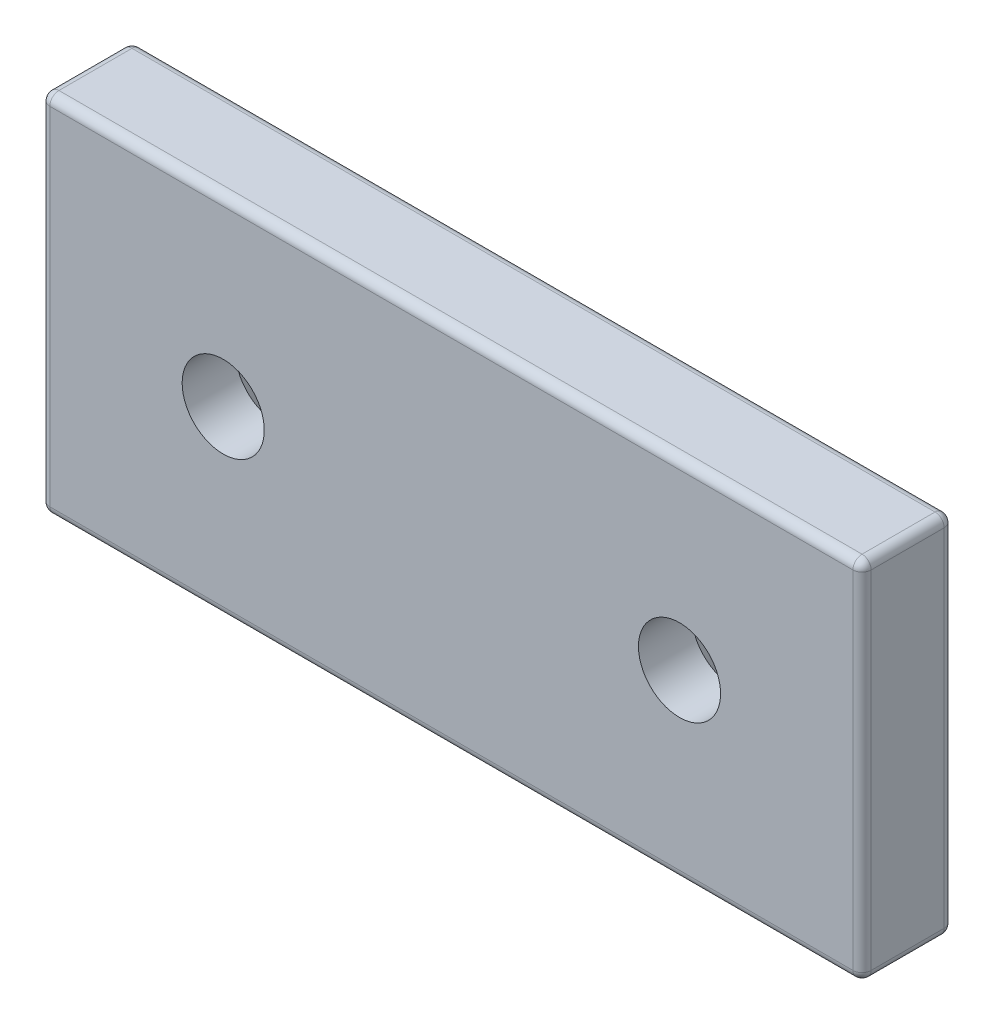
ISO-10303-21;
HEADER;
FILE_DESCRIPTION(('STEP AP214'),'2;1');
FILE_NAME('part.step','',(''),(''),'','','');
FILE_SCHEMA(('AUTOMOTIVE_DESIGN { 1 0 10303 214 1 1 1 1 }'));
ENDSEC;
DATA;
#1=APPLICATION_CONTEXT('core data for automotive mechanical design processes');
#2=APPLICATION_PROTOCOL_DEFINITION('international standard','automotive_design',2000,#1);
#3=PRODUCT_CONTEXT('',#1,'mechanical');
#4=PRODUCT('Part','Part','',(#3));
#5=PRODUCT_RELATED_PRODUCT_CATEGORY('part','',(#4));
#6=PRODUCT_DEFINITION_FORMATION('','',#4);
#7=PRODUCT_DEFINITION_CONTEXT('part definition',#1,'design');
#8=PRODUCT_DEFINITION('design','',#6,#7);
#9=PRODUCT_DEFINITION_SHAPE('','',#8);
#10=(LENGTH_UNIT() NAMED_UNIT(*) SI_UNIT(.MILLI.,.METRE.));
#11=(NAMED_UNIT(*) PLANE_ANGLE_UNIT() SI_UNIT($,.RADIAN.));
#12=(NAMED_UNIT(*) SI_UNIT($,.STERADIAN.) SOLID_ANGLE_UNIT());
#13=UNCERTAINTY_MEASURE_WITH_UNIT(LENGTH_MEASURE(1.E-05),#10,'distance_accuracy_value','');
#14=(GEOMETRIC_REPRESENTATION_CONTEXT(3) GLOBAL_UNCERTAINTY_ASSIGNED_CONTEXT((#13)) GLOBAL_UNIT_ASSIGNED_CONTEXT((#10,
#11,#12)) REPRESENTATION_CONTEXT('',''));
#15=CARTESIAN_POINT('',(0.,0.,0.));
#16=DIRECTION('',(0.,0.,1.));
#17=DIRECTION('',(1.,0.,0.));
#18=AXIS2_PLACEMENT_3D('',#15,#16,#17);
#19=CARTESIAN_POINT('',(45.,-20.,10.));
#20=DIRECTION('',(-1.,0.,0.));
#21=DIRECTION('',(0.,0.,1.));
#22=AXIS2_PLACEMENT_3D('',#19,#20,#21);
#23=PLANE('',#22);
#24=DIRECTION('',(0.,0.,-1.));
#25=VECTOR('',#24,1.);
#26=CARTESIAN_POINT('',(45.,-19.,10.));
#27=LINE('',#26,#25);
#28=CARTESIAN_POINT('',(45.,-19.,9.));
#29=VERTEX_POINT('',#28);
#30=CARTESIAN_POINT('',(45.,-19.,0.999999999999999));
#31=VERTEX_POINT('',#30);
#32=EDGE_CURVE('E145',#29,#31,#27,.T.);
#33=ORIENTED_EDGE('',*,*,#32,.T.);
#34=DIRECTION('',(0.,1.,0.));
#35=VECTOR('',#34,1.);
#36=CARTESIAN_POINT('',(45.,20.,0.999999999999999));
#37=LINE('',#36,#35);
#38=CARTESIAN_POINT('',(45.,19.,0.999999999999999));
#39=VERTEX_POINT('',#38);
#40=EDGE_CURVE('E195',#31,#39,#37,.T.);
#41=ORIENTED_EDGE('',*,*,#40,.T.);
#42=DIRECTION('',(0.,0.,-1.));
#43=VECTOR('',#42,1.);
#44=CARTESIAN_POINT('',(45.,19.,10.));
#45=LINE('',#44,#43);
#46=CARTESIAN_POINT('',(45.,19.,9.));
#47=VERTEX_POINT('',#46);
#48=EDGE_CURVE('E192',#39,#47,#45,.F.);
#49=ORIENTED_EDGE('',*,*,#48,.T.);
#50=DIRECTION('',(0.,1.,0.));
#51=VECTOR('',#50,1.);
#52=CARTESIAN_POINT('',(45.,-20.,9.));
#53=LINE('',#52,#51);
#54=EDGE_CURVE('E190',#47,#29,#53,.F.);
#55=ORIENTED_EDGE('',*,*,#54,.T.);
#56=EDGE_LOOP('',(#33,#41,#49,#55));
#57=FACE_BOUND('',#56,.T.);
#58=ADVANCED_FACE('F37',(#57),#23,.F.);
#59=CARTESIAN_POINT('',(-45.,20.,10.));
#60=DIRECTION('',(0.,-1.,0.));
#61=DIRECTION('',(0.,0.,-1.));
#62=AXIS2_PLACEMENT_3D('',#59,#60,#61);
#63=PLANE('',#62);
#64=DIRECTION('',(0.,0.,-1.));
#65=VECTOR('',#64,1.);
#66=CARTESIAN_POINT('',(44.,20.,10.));
#67=LINE('',#66,#65);
#68=CARTESIAN_POINT('',(44.,20.,9.));
#69=VERTEX_POINT('',#68);
#70=CARTESIAN_POINT('',(44.,20.,0.999999999999999));
#71=VERTEX_POINT('',#70);
#72=EDGE_CURVE('E183',#69,#71,#67,.T.);
#73=ORIENTED_EDGE('',*,*,#72,.T.);
#74=DIRECTION('',(-1.,0.,0.));
#75=VECTOR('',#74,1.);
#76=CARTESIAN_POINT('',(-45.,20.,0.999999999999999));
#77=LINE('',#76,#75);
#78=CARTESIAN_POINT('',(-44.,20.,0.999999999999999));
#79=VERTEX_POINT('',#78);
#80=EDGE_CURVE('E188',#71,#79,#77,.T.);
#81=ORIENTED_EDGE('',*,*,#80,.T.);
#82=DIRECTION('',(0.,0.,-1.));
#83=VECTOR('',#82,1.);
#84=CARTESIAN_POINT('',(-44.,20.,10.));
#85=LINE('',#84,#83);
#86=CARTESIAN_POINT('',(-44.,20.,9.));
#87=VERTEX_POINT('',#86);
#88=EDGE_CURVE('E185',#79,#87,#85,.F.);
#89=ORIENTED_EDGE('',*,*,#88,.T.);
#90=DIRECTION('',(-1.,0.,0.));
#91=VECTOR('',#90,1.);
#92=CARTESIAN_POINT('',(-45.,20.,9.));
#93=LINE('',#92,#91);
#94=EDGE_CURVE('E181',#87,#69,#93,.F.);
#95=ORIENTED_EDGE('',*,*,#94,.T.);
#96=EDGE_LOOP('',(#73,#81,#89,#95));
#97=FACE_BOUND('',#96,.T.);
#98=ADVANCED_FACE('F300',(#97),#63,.F.);
#99=CARTESIAN_POINT('',(-45.,-20.,10.));
#100=DIRECTION('',(1.,0.,0.));
#101=DIRECTION('',(0.,0.,-1.));
#102=AXIS2_PLACEMENT_3D('',#99,#100,#101);
#103=PLANE('',#102);
#104=DIRECTION('',(0.,0.,-1.));
#105=VECTOR('',#104,1.);
#106=CARTESIAN_POINT('',(-45.,19.,10.));
#107=LINE('',#106,#105);
#108=CARTESIAN_POINT('',(-45.,19.,9.));
#109=VERTEX_POINT('',#108);
#110=CARTESIAN_POINT('',(-45.,19.,0.999999999999999));
#111=VERTEX_POINT('',#110);
#112=EDGE_CURVE('E174',#109,#111,#107,.T.);
#113=ORIENTED_EDGE('',*,*,#112,.T.);
#114=DIRECTION('',(0.,-1.,0.));
#115=VECTOR('',#114,1.);
#116=CARTESIAN_POINT('',(-45.,-20.,0.999999999999999));
#117=LINE('',#116,#115);
#118=CARTESIAN_POINT('',(-45.,-19.,0.999999999999999));
#119=VERTEX_POINT('',#118);
#120=EDGE_CURVE('E179',#111,#119,#117,.T.);
#121=ORIENTED_EDGE('',*,*,#120,.T.);
#122=DIRECTION('',(0.,0.,-1.));
#123=VECTOR('',#122,1.);
#124=CARTESIAN_POINT('',(-45.,-19.,10.));
#125=LINE('',#124,#123);
#126=CARTESIAN_POINT('',(-45.,-19.,9.));
#127=VERTEX_POINT('',#126);
#128=EDGE_CURVE('E176',#119,#127,#125,.F.);
#129=ORIENTED_EDGE('',*,*,#128,.T.);
#130=DIRECTION('',(0.,-1.,0.));
#131=VECTOR('',#130,1.);
#132=CARTESIAN_POINT('',(-45.,-20.,9.));
#133=LINE('',#132,#131);
#134=EDGE_CURVE('E172',#127,#109,#133,.F.);
#135=ORIENTED_EDGE('',*,*,#134,.T.);
#136=EDGE_LOOP('',(#113,#121,#129,#135));
#137=FACE_BOUND('',#136,.T.);
#138=ADVANCED_FACE('F291',(#137),#103,.F.);
#139=CARTESIAN_POINT('',(-45.,-20.,10.));
#140=DIRECTION('',(0.,1.,0.));
#141=DIRECTION('',(0.,0.,1.));
#142=AXIS2_PLACEMENT_3D('',#139,#140,#141);
#143=PLANE('',#142);
#144=DIRECTION('',(0.,0.,-1.));
#145=VECTOR('',#144,1.);
#146=CARTESIAN_POINT('',(-44.,-20.,10.));
#147=LINE('',#146,#145);
#148=CARTESIAN_POINT('',(-44.,-20.,9.));
#149=VERTEX_POINT('',#148);
#150=CARTESIAN_POINT('',(-44.,-20.,0.999999999999999));
#151=VERTEX_POINT('',#150);
#152=EDGE_CURVE('E137',#149,#151,#147,.T.);
#153=ORIENTED_EDGE('',*,*,#152,.T.);
#154=DIRECTION('',(1.,0.,0.));
#155=VECTOR('',#154,1.);
#156=CARTESIAN_POINT('',(45.,-20.,0.999999999999999));
#157=LINE('',#156,#155);
#158=CARTESIAN_POINT('',(44.,-20.,0.999999999999999));
#159=VERTEX_POINT('',#158);
#160=EDGE_CURVE('E133',#151,#159,#157,.T.);
#161=ORIENTED_EDGE('',*,*,#160,.T.);
#162=DIRECTION('',(0.,0.,-1.));
#163=VECTOR('',#162,1.);
#164=CARTESIAN_POINT('',(44.,-20.,10.));
#165=LINE('',#164,#163);
#166=CARTESIAN_POINT('',(44.,-20.,9.));
#167=VERTEX_POINT('',#166);
#168=EDGE_CURVE('E125',#159,#167,#165,.F.);
#169=ORIENTED_EDGE('',*,*,#168,.T.);
#170=DIRECTION('',(1.,0.,0.));
#171=VECTOR('',#170,1.);
#172=CARTESIAN_POINT('',(-45.,-20.,9.));
#173=LINE('',#172,#171);
#174=EDGE_CURVE('E130',#167,#149,#173,.F.);
#175=ORIENTED_EDGE('',*,*,#174,.T.);
#176=EDGE_LOOP('',(#153,#161,#169,#175));
#177=FACE_BOUND('',#176,.T.);
#178=ADVANCED_FACE('F128',(#177),#143,.F.);
#179=CARTESIAN_POINT('',(0.,0.,10.));
#180=DIRECTION('',(0.,0.,-1.));
#181=DIRECTION('',(-1.,0.,0.));
#182=AXIS2_PLACEMENT_3D('',#179,#180,#181);
#183=PLANE('',#182);
#184=CARTESIAN_POINT('',(-25.,0.,10.));
#185=DIRECTION('',(0.,0.,-1.));
#186=DIRECTION('',(-1.,0.,0.));
#187=AXIS2_PLACEMENT_3D('',#184,#185,#186);
#188=CIRCLE('',#187,4.5);
#189=CARTESIAN_POINT('',(-29.5,0.,10.));
#190=VERTEX_POINT('',#189);
#191=EDGE_CURVE('E582',#190,#190,#188,.T.);
#192=ORIENTED_EDGE('',*,*,#191,.T.);
#193=EDGE_LOOP('',(#192));
#194=FACE_BOUND('',#193,.T.);
#195=CARTESIAN_POINT('',(25.,0.,10.));
#196=DIRECTION('',(0.,0.,-1.));
#197=DIRECTION('',(-1.,0.,0.));
#198=AXIS2_PLACEMENT_3D('',#195,#196,#197);
#199=CIRCLE('',#198,4.5);
#200=CARTESIAN_POINT('',(20.5,0.,10.));
#201=VERTEX_POINT('',#200);
#202=EDGE_CURVE('E167',#201,#201,#199,.T.);
#203=ORIENTED_EDGE('',*,*,#202,.T.);
#204=EDGE_LOOP('',(#203));
#205=FACE_BOUND('',#204,.T.);
#206=DIRECTION('',(0.,-1.,0.));
#207=VECTOR('',#206,1.);
#208=CARTESIAN_POINT('',(-44.,0.,10.));
#209=LINE('',#208,#207);
#210=CARTESIAN_POINT('',(-44.,19.,10.));
#211=VERTEX_POINT('',#210);
#212=CARTESIAN_POINT('',(-44.,-19.,10.));
#213=VERTEX_POINT('',#212);
#214=EDGE_CURVE('E46',#211,#213,#209,.T.);
#215=ORIENTED_EDGE('',*,*,#214,.T.);
#216=DIRECTION('',(1.,0.,0.));
#217=VECTOR('',#216,1.);
#218=CARTESIAN_POINT('',(0.,-19.,10.));
#219=LINE('',#218,#217);
#220=CARTESIAN_POINT('',(44.,-19.,10.));
#221=VERTEX_POINT('',#220);
#222=EDGE_CURVE('E11',#213,#221,#219,.T.);
#223=ORIENTED_EDGE('',*,*,#222,.T.);
#224=DIRECTION('',(0.,1.,0.));
#225=VECTOR('',#224,1.);
#226=CARTESIAN_POINT('',(44.,0.,10.));
#227=LINE('',#226,#225);
#228=CARTESIAN_POINT('',(44.,19.,10.));
#229=VERTEX_POINT('',#228);
#230=EDGE_CURVE('E206',#221,#229,#227,.T.);
#231=ORIENTED_EDGE('',*,*,#230,.T.);
#232=DIRECTION('',(-1.,0.,0.));
#233=VECTOR('',#232,1.);
#234=CARTESIAN_POINT('',(0.,19.,10.));
#235=LINE('',#234,#233);
#236=EDGE_CURVE('E57',#229,#211,#235,.T.);
#237=ORIENTED_EDGE('',*,*,#236,.T.);
#238=EDGE_LOOP('',(#215,#223,#231,#237));
#239=FACE_BOUND('',#238,.T.);
#240=ADVANCED_FACE('F532',(#194,#205,#239),#183,.F.);
#241=CARTESIAN_POINT('',(0.,0.,0.));
#242=DIRECTION('',(0.,0.,-1.));
#243=DIRECTION('',(-1.,0.,0.));
#244=AXIS2_PLACEMENT_3D('',#241,#242,#243);
#245=PLANE('',#244);
#246=CARTESIAN_POINT('',(-25.,0.,0.));
#247=DIRECTION('',(0.,0.,-1.));
#248=DIRECTION('',(-1.,0.,0.));
#249=AXIS2_PLACEMENT_3D('',#246,#247,#248);
#250=CIRCLE('',#249,8.65);
#251=CARTESIAN_POINT('',(-33.65,0.,0.));
#252=VERTEX_POINT('',#251);
#253=EDGE_CURVE('E597',#252,#252,#250,.T.);
#254=ORIENTED_EDGE('',*,*,#253,.F.);
#255=EDGE_LOOP('',(#254));
#256=FACE_BOUND('',#255,.T.);
#257=CARTESIAN_POINT('',(25.,0.,0.));
#258=DIRECTION('',(0.,0.,-1.));
#259=DIRECTION('',(-1.,0.,0.));
#260=AXIS2_PLACEMENT_3D('',#257,#258,#259);
#261=CIRCLE('',#260,8.65);
#262=CARTESIAN_POINT('',(16.35,0.,0.));
#263=VERTEX_POINT('',#262);
#264=EDGE_CURVE('E587',#263,#263,#261,.T.);
#265=ORIENTED_EDGE('',*,*,#264,.F.);
#266=EDGE_LOOP('',(#265));
#267=FACE_BOUND('',#266,.T.);
#268=DIRECTION('',(0.,-1.,0.));
#269=VECTOR('',#268,1.);
#270=CARTESIAN_POINT('',(-44.,20.,0.));
#271=LINE('',#270,#269);
#272=CARTESIAN_POINT('',(-44.,-19.,0.));
#273=VERTEX_POINT('',#272);
#274=CARTESIAN_POINT('',(-44.,19.,0.));
#275=VERTEX_POINT('',#274);
#276=EDGE_CURVE('E201',#273,#275,#271,.F.);
#277=ORIENTED_EDGE('',*,*,#276,.T.);
#278=DIRECTION('',(-1.,0.,0.));
#279=VECTOR('',#278,1.);
#280=CARTESIAN_POINT('',(45.,19.,0.));
#281=LINE('',#280,#279);
#282=CARTESIAN_POINT('',(44.,19.,0.));
#283=VERTEX_POINT('',#282);
#284=EDGE_CURVE('E203',#275,#283,#281,.F.);
#285=ORIENTED_EDGE('',*,*,#284,.T.);
#286=DIRECTION('',(0.,1.,0.));
#287=VECTOR('',#286,1.);
#288=CARTESIAN_POINT('',(44.,-20.,0.));
#289=LINE('',#288,#287);
#290=CARTESIAN_POINT('',(44.,-19.,0.));
#291=VERTEX_POINT('',#290);
#292=EDGE_CURVE('E197',#283,#291,#289,.F.);
#293=ORIENTED_EDGE('',*,*,#292,.T.);
#294=DIRECTION('',(1.,0.,0.));
#295=VECTOR('',#294,1.);
#296=CARTESIAN_POINT('',(-45.,-19.,0.));
#297=LINE('',#296,#295);
#298=EDGE_CURVE('E199',#291,#273,#297,.F.);
#299=ORIENTED_EDGE('',*,*,#298,.T.);
#300=EDGE_LOOP('',(#277,#285,#293,#299));
#301=FACE_BOUND('',#300,.T.);
#302=ADVANCED_FACE('F273',(#256,#267,#301),#245,.T.);
#303=CARTESIAN_POINT('',(44.,19.,10.));
#304=DIRECTION('',(0.,0.,-1.));
#305=DIRECTION('',(-1.,0.,0.));
#306=AXIS2_PLACEMENT_3D('',#303,#304,#305);
#307=CYLINDRICAL_SURFACE('',#306,1.);
#308=CARTESIAN_POINT('',(44.,19.,9.));
#309=DIRECTION('',(0.,0.,1.));
#310=DIRECTION('',(1.,0.,0.));
#311=AXIS2_PLACEMENT_3D('',#308,#309,#310);
#312=CIRCLE('',#311,1.);
#313=EDGE_CURVE('E41',#47,#69,#312,.T.);
#314=ORIENTED_EDGE('',*,*,#313,.F.);
#315=ORIENTED_EDGE('',*,*,#48,.F.);
#316=CARTESIAN_POINT('',(44.,19.,0.999999999999999));
#317=DIRECTION('',(0.,0.,-1.));
#318=DIRECTION('',(-1.,0.,0.));
#319=AXIS2_PLACEMENT_3D('',#316,#317,#318);
#320=CIRCLE('',#319,1.);
#321=EDGE_CURVE('E165',#71,#39,#320,.T.);
#322=ORIENTED_EDGE('',*,*,#321,.F.);
#323=ORIENTED_EDGE('',*,*,#72,.F.);
#324=EDGE_LOOP('',(#314,#315,#322,#323));
#325=FACE_BOUND('',#324,.T.);
#326=ADVANCED_FACE('F39',(#325),#307,.T.);
#327=CARTESIAN_POINT('',(44.,19.,9.));
#328=DIRECTION('',(0.,0.,1.));
#329=DIRECTION('',(1.,0.,0.));
#330=AXIS2_PLACEMENT_3D('',#327,#328,#329);
#331=SPHERICAL_SURFACE('',#330,1.);
#332=CARTESIAN_POINT('',(44.,19.,9.));
#333=DIRECTION('',(0.,1.,0.));
#334=DIRECTION('',(0.,0.,1.));
#335=AXIS2_PLACEMENT_3D('',#332,#333,#334);
#336=CIRCLE('',#335,1.);
#337=EDGE_CURVE('E252',#47,#229,#336,.F.);
#338=ORIENTED_EDGE('',*,*,#337,.F.);
#339=ORIENTED_EDGE('',*,*,#313,.T.);
#340=CARTESIAN_POINT('',(44.,19.,9.));
#341=DIRECTION('',(1.,0.,0.));
#342=DIRECTION('',(0.,0.,-1.));
#343=AXIS2_PLACEMENT_3D('',#340,#341,#342);
#344=CIRCLE('',#343,1.);
#345=EDGE_CURVE('E255',#229,#69,#344,.F.);
#346=ORIENTED_EDGE('',*,*,#345,.F.);
#347=EDGE_LOOP('',(#338,#339,#346));
#348=FACE_BOUND('',#347,.T.);
#349=ADVANCED_FACE('F305',(#348),#331,.T.);
#350=CARTESIAN_POINT('',(44.,19.,1.));
#351=DIRECTION('',(0.,0.,1.));
#352=DIRECTION('',(1.,0.,0.));
#353=AXIS2_PLACEMENT_3D('',#350,#351,#352);
#354=SPHERICAL_SURFACE('',#353,1.);
#355=CARTESIAN_POINT('',(44.,19.,1.));
#356=DIRECTION('',(1.,0.,0.));
#357=DIRECTION('',(0.,0.,-1.));
#358=AXIS2_PLACEMENT_3D('',#355,#356,#357);
#359=CIRCLE('',#358,1.);
#360=EDGE_CURVE('E246',#71,#283,#359,.F.);
#361=ORIENTED_EDGE('',*,*,#360,.F.);
#362=ORIENTED_EDGE('',*,*,#321,.T.);
#363=CARTESIAN_POINT('',(44.,19.,0.999999999999999));
#364=DIRECTION('',(0.,1.,0.));
#365=DIRECTION('',(0.,0.,1.));
#366=AXIS2_PLACEMENT_3D('',#363,#364,#365);
#367=CIRCLE('',#366,1.);
#368=EDGE_CURVE('E249',#283,#39,#367,.F.);
#369=ORIENTED_EDGE('',*,*,#368,.F.);
#370=EDGE_LOOP('',(#361,#362,#369));
#371=FACE_BOUND('',#370,.T.);
#372=ADVANCED_FACE('F262',(#371),#354,.T.);
#373=CARTESIAN_POINT('',(0.,19.,9.));
#374=DIRECTION('',(-1.,0.,0.));
#375=DIRECTION('',(0.,0.,1.));
#376=AXIS2_PLACEMENT_3D('',#373,#374,#375);
#377=CYLINDRICAL_SURFACE('',#376,1.);
#378=ORIENTED_EDGE('',*,*,#345,.T.);
#379=ORIENTED_EDGE('',*,*,#94,.F.);
#380=CARTESIAN_POINT('',(-44.,19.,9.));
#381=DIRECTION('',(-1.,0.,0.));
#382=DIRECTION('',(0.,0.,1.));
#383=AXIS2_PLACEMENT_3D('',#380,#381,#382);
#384=CIRCLE('',#383,1.);
#385=EDGE_CURVE('E241',#211,#87,#384,.T.);
#386=ORIENTED_EDGE('',*,*,#385,.F.);
#387=ORIENTED_EDGE('',*,*,#236,.F.);
#388=EDGE_LOOP('',(#378,#379,#386,#387));
#389=FACE_BOUND('',#388,.T.);
#390=ADVANCED_FACE('F308',(#389),#377,.T.);
#391=CARTESIAN_POINT('',(44.,0.,9.));
#392=DIRECTION('',(0.,1.,0.));
#393=DIRECTION('',(0.,0.,1.));
#394=AXIS2_PLACEMENT_3D('',#391,#392,#393);
#395=CYLINDRICAL_SURFACE('',#394,1.);
#396=ORIENTED_EDGE('',*,*,#337,.T.);
#397=ORIENTED_EDGE('',*,*,#230,.F.);
#398=CARTESIAN_POINT('',(44.,-19.,9.));
#399=DIRECTION('',(0.,-1.,0.));
#400=DIRECTION('',(0.,0.,-1.));
#401=AXIS2_PLACEMENT_3D('',#398,#399,#400);
#402=CIRCLE('',#401,1.);
#403=EDGE_CURVE('E149',#29,#221,#402,.T.);
#404=ORIENTED_EDGE('',*,*,#403,.F.);
#405=ORIENTED_EDGE('',*,*,#54,.F.);
#406=EDGE_LOOP('',(#396,#397,#404,#405));
#407=FACE_BOUND('',#406,.T.);
#408=ADVANCED_FACE('F490',(#407),#395,.T.);
#409=CARTESIAN_POINT('',(44.,-19.,10.));
#410=DIRECTION('',(0.,0.,-1.));
#411=DIRECTION('',(-1.,0.,0.));
#412=AXIS2_PLACEMENT_3D('',#409,#410,#411);
#413=CYLINDRICAL_SURFACE('',#412,1.);
#414=CARTESIAN_POINT('',(44.,-19.,0.999999999999999));
#415=DIRECTION('',(0.,0.,-1.));
#416=DIRECTION('',(-1.,0.,0.));
#417=AXIS2_PLACEMENT_3D('',#414,#415,#416);
#418=CIRCLE('',#417,1.);
#419=EDGE_CURVE('E150',#31,#159,#418,.T.);
#420=ORIENTED_EDGE('',*,*,#419,.F.);
#421=ORIENTED_EDGE('',*,*,#32,.F.);
#422=CARTESIAN_POINT('',(44.,-19.,9.));
#423=DIRECTION('',(0.,0.,1.));
#424=DIRECTION('',(1.,0.,0.));
#425=AXIS2_PLACEMENT_3D('',#422,#423,#424);
#426=CIRCLE('',#425,1.);
#427=EDGE_CURVE('E141',#167,#29,#426,.T.);
#428=ORIENTED_EDGE('',*,*,#427,.F.);
#429=ORIENTED_EDGE('',*,*,#168,.F.);
#430=EDGE_LOOP('',(#420,#421,#428,#429));
#431=FACE_BOUND('',#430,.T.);
#432=ADVANCED_FACE('F143',(#431),#413,.T.);
#433=CARTESIAN_POINT('',(44.,-20.,0.999999999999999));
#434=DIRECTION('',(0.,-1.,0.));
#435=DIRECTION('',(0.,0.,-1.));
#436=AXIS2_PLACEMENT_3D('',#433,#434,#435);
#437=CYLINDRICAL_SURFACE('',#436,1.);
#438=ORIENTED_EDGE('',*,*,#368,.T.);
#439=ORIENTED_EDGE('',*,*,#40,.F.);
#440=CARTESIAN_POINT('',(44.,-19.,1.));
#441=DIRECTION('',(0.,-1.,0.));
#442=DIRECTION('',(0.,0.,-1.));
#443=AXIS2_PLACEMENT_3D('',#440,#441,#442);
#444=CIRCLE('',#443,1.);
#445=EDGE_CURVE('E237',#291,#31,#444,.T.);
#446=ORIENTED_EDGE('',*,*,#445,.F.);
#447=ORIENTED_EDGE('',*,*,#292,.F.);
#448=EDGE_LOOP('',(#438,#439,#446,#447));
#449=FACE_BOUND('',#448,.T.);
#450=ADVANCED_FACE('F269',(#449),#437,.T.);
#451=CARTESIAN_POINT('',(-45.,19.,0.999999999999999));
#452=DIRECTION('',(1.,0.,0.));
#453=DIRECTION('',(0.,0.,-1.));
#454=AXIS2_PLACEMENT_3D('',#451,#452,#453);
#455=CYLINDRICAL_SURFACE('',#454,1.);
#456=ORIENTED_EDGE('',*,*,#360,.T.);
#457=ORIENTED_EDGE('',*,*,#284,.F.);
#458=CARTESIAN_POINT('',(-44.,19.,0.999999999999999));
#459=DIRECTION('',(-1.,0.,0.));
#460=DIRECTION('',(0.,0.,1.));
#461=AXIS2_PLACEMENT_3D('',#458,#459,#460);
#462=CIRCLE('',#461,1.);
#463=EDGE_CURVE('E234',#79,#275,#462,.T.);
#464=ORIENTED_EDGE('',*,*,#463,.F.);
#465=ORIENTED_EDGE('',*,*,#80,.F.);
#466=EDGE_LOOP('',(#456,#457,#464,#465));
#467=FACE_BOUND('',#466,.T.);
#468=ADVANCED_FACE('F279',(#467),#455,.T.);
#469=CARTESIAN_POINT('',(-44.,19.,10.));
#470=DIRECTION('',(0.,0.,-1.));
#471=DIRECTION('',(-1.,0.,0.));
#472=AXIS2_PLACEMENT_3D('',#469,#470,#471);
#473=CYLINDRICAL_SURFACE('',#472,1.);
#474=CARTESIAN_POINT('',(-44.,19.,9.));
#475=DIRECTION('',(0.,0.,1.));
#476=DIRECTION('',(1.,0.,0.));
#477=AXIS2_PLACEMENT_3D('',#474,#475,#476);
#478=CIRCLE('',#477,1.);
#479=EDGE_CURVE('E243',#87,#109,#478,.T.);
#480=ORIENTED_EDGE('',*,*,#479,.F.);
#481=ORIENTED_EDGE('',*,*,#88,.F.);
#482=CARTESIAN_POINT('',(-44.,19.,0.999999999999999));
#483=DIRECTION('',(0.,0.,-1.));
#484=DIRECTION('',(-1.,0.,0.));
#485=AXIS2_PLACEMENT_3D('',#482,#483,#484);
#486=CIRCLE('',#485,1.);
#487=EDGE_CURVE('E231',#111,#79,#486,.T.);
#488=ORIENTED_EDGE('',*,*,#487,.F.);
#489=ORIENTED_EDGE('',*,*,#112,.F.);
#490=EDGE_LOOP('',(#480,#481,#488,#489));
#491=FACE_BOUND('',#490,.T.);
#492=ADVANCED_FACE('F297',(#491),#473,.T.);
#493=CARTESIAN_POINT('',(-44.,19.,9.));
#494=DIRECTION('',(0.,0.,1.));
#495=DIRECTION('',(1.,0.,0.));
#496=AXIS2_PLACEMENT_3D('',#493,#494,#495);
#497=SPHERICAL_SURFACE('',#496,1.);
#498=ORIENTED_EDGE('',*,*,#385,.T.);
#499=ORIENTED_EDGE('',*,*,#479,.T.);
#500=CARTESIAN_POINT('',(-44.,19.,9.));
#501=DIRECTION('',(0.,1.,0.));
#502=DIRECTION('',(0.,0.,1.));
#503=AXIS2_PLACEMENT_3D('',#500,#501,#502);
#504=CIRCLE('',#503,1.);
#505=EDGE_CURVE('E156',#211,#109,#504,.F.);
#506=ORIENTED_EDGE('',*,*,#505,.F.);
#507=EDGE_LOOP('',(#498,#499,#506));
#508=FACE_BOUND('',#507,.T.);
#509=ADVANCED_FACE('F311',(#508),#497,.T.);
#510=CARTESIAN_POINT('',(44.,-19.,9.));
#511=DIRECTION('',(0.,0.,1.));
#512=DIRECTION('',(1.,0.,0.));
#513=AXIS2_PLACEMENT_3D('',#510,#511,#512);
#514=SPHERICAL_SURFACE('',#513,1.);
#515=ORIENTED_EDGE('',*,*,#427,.T.);
#516=ORIENTED_EDGE('',*,*,#403,.T.);
#517=CARTESIAN_POINT('',(44.,-19.,9.));
#518=DIRECTION('',(1.,0.,0.));
#519=DIRECTION('',(0.,0.,-1.));
#520=AXIS2_PLACEMENT_3D('',#517,#518,#519);
#521=CIRCLE('',#520,1.);
#522=EDGE_CURVE('E152',#167,#221,#521,.F.);
#523=ORIENTED_EDGE('',*,*,#522,.F.);
#524=EDGE_LOOP('',(#515,#516,#523));
#525=FACE_BOUND('',#524,.T.);
#526=ADVANCED_FACE('F153',(#525),#514,.T.);
#527=CARTESIAN_POINT('',(44.,-19.,1.));
#528=DIRECTION('',(0.,0.,1.));
#529=DIRECTION('',(1.,0.,0.));
#530=AXIS2_PLACEMENT_3D('',#527,#528,#529);
#531=SPHERICAL_SURFACE('',#530,1.);
#532=ORIENTED_EDGE('',*,*,#445,.T.);
#533=ORIENTED_EDGE('',*,*,#419,.T.);
#534=CARTESIAN_POINT('',(44.,-19.,0.999999999999999));
#535=DIRECTION('',(1.,0.,0.));
#536=DIRECTION('',(0.,0.,-1.));
#537=AXIS2_PLACEMENT_3D('',#534,#535,#536);
#538=CIRCLE('',#537,1.);
#539=EDGE_CURVE('E157',#291,#159,#538,.F.);
#540=ORIENTED_EDGE('',*,*,#539,.F.);
#541=EDGE_LOOP('',(#532,#533,#540));
#542=FACE_BOUND('',#541,.T.);
#543=ADVANCED_FACE('F326',(#542),#531,.T.);
#544=CARTESIAN_POINT('',(-44.,19.,1.));
#545=DIRECTION('',(0.,0.,1.));
#546=DIRECTION('',(1.,0.,0.));
#547=AXIS2_PLACEMENT_3D('',#544,#545,#546);
#548=SPHERICAL_SURFACE('',#547,1.);
#549=ORIENTED_EDGE('',*,*,#487,.T.);
#550=ORIENTED_EDGE('',*,*,#463,.T.);
#551=CARTESIAN_POINT('',(-44.,19.,1.));
#552=DIRECTION('',(0.,1.,0.));
#553=DIRECTION('',(0.,0.,1.));
#554=AXIS2_PLACEMENT_3D('',#551,#552,#553);
#555=CIRCLE('',#554,1.);
#556=EDGE_CURVE('E224',#111,#275,#555,.F.);
#557=ORIENTED_EDGE('',*,*,#556,.F.);
#558=EDGE_LOOP('',(#549,#550,#557));
#559=FACE_BOUND('',#558,.T.);
#560=ADVANCED_FACE('F282',(#559),#548,.T.);
#561=CARTESIAN_POINT('',(-44.,0.,9.));
#562=DIRECTION('',(0.,-1.,0.));
#563=DIRECTION('',(0.,0.,-1.));
#564=AXIS2_PLACEMENT_3D('',#561,#562,#563);
#565=CYLINDRICAL_SURFACE('',#564,1.);
#566=ORIENTED_EDGE('',*,*,#505,.T.);
#567=ORIENTED_EDGE('',*,*,#134,.F.);
#568=CARTESIAN_POINT('',(-44.,-19.,9.));
#569=DIRECTION('',(0.,-1.,0.));
#570=DIRECTION('',(0.,0.,-1.));
#571=AXIS2_PLACEMENT_3D('',#568,#569,#570);
#572=CIRCLE('',#571,1.);
#573=EDGE_CURVE('E221',#213,#127,#572,.T.);
#574=ORIENTED_EDGE('',*,*,#573,.F.);
#575=ORIENTED_EDGE('',*,*,#214,.F.);
#576=EDGE_LOOP('',(#566,#567,#574,#575));
#577=FACE_BOUND('',#576,.T.);
#578=ADVANCED_FACE('F314',(#577),#565,.T.);
#579=CARTESIAN_POINT('',(0.,-19.,9.));
#580=DIRECTION('',(1.,0.,0.));
#581=DIRECTION('',(0.,0.,-1.));
#582=AXIS2_PLACEMENT_3D('',#579,#580,#581);
#583=CYLINDRICAL_SURFACE('',#582,1.);
#584=ORIENTED_EDGE('',*,*,#522,.T.);
#585=ORIENTED_EDGE('',*,*,#222,.F.);
#586=CARTESIAN_POINT('',(-44.,-19.,9.));
#587=DIRECTION('',(-1.,0.,0.));
#588=DIRECTION('',(0.,0.,1.));
#589=AXIS2_PLACEMENT_3D('',#586,#587,#588);
#590=CIRCLE('',#589,1.);
#591=EDGE_CURVE('E161',#149,#213,#590,.T.);
#592=ORIENTED_EDGE('',*,*,#591,.F.);
#593=ORIENTED_EDGE('',*,*,#174,.F.);
#594=EDGE_LOOP('',(#584,#585,#592,#593));
#595=FACE_BOUND('',#594,.T.);
#596=ADVANCED_FACE('F159',(#595),#583,.T.);
#597=CARTESIAN_POINT('',(-45.,-19.,0.999999999999999));
#598=DIRECTION('',(-1.,0.,0.));
#599=DIRECTION('',(0.,0.,1.));
#600=AXIS2_PLACEMENT_3D('',#597,#598,#599);
#601=CYLINDRICAL_SURFACE('',#600,1.);
#602=ORIENTED_EDGE('',*,*,#539,.T.);
#603=ORIENTED_EDGE('',*,*,#160,.F.);
#604=CARTESIAN_POINT('',(-44.,-19.,1.));
#605=DIRECTION('',(-1.,0.,0.));
#606=DIRECTION('',(0.,0.,1.));
#607=AXIS2_PLACEMENT_3D('',#604,#605,#606);
#608=CIRCLE('',#607,1.);
#609=EDGE_CURVE('E217',#273,#151,#608,.T.);
#610=ORIENTED_EDGE('',*,*,#609,.F.);
#611=ORIENTED_EDGE('',*,*,#298,.F.);
#612=EDGE_LOOP('',(#602,#603,#610,#611));
#613=FACE_BOUND('',#612,.T.);
#614=ADVANCED_FACE('F324',(#613),#601,.T.);
#615=CARTESIAN_POINT('',(-44.,-20.,0.999999999999999));
#616=DIRECTION('',(0.,1.,0.));
#617=DIRECTION('',(0.,0.,1.));
#618=AXIS2_PLACEMENT_3D('',#615,#616,#617);
#619=CYLINDRICAL_SURFACE('',#618,1.);
#620=ORIENTED_EDGE('',*,*,#556,.T.);
#621=ORIENTED_EDGE('',*,*,#276,.F.);
#622=CARTESIAN_POINT('',(-44.,-19.,0.999999999999999));
#623=DIRECTION('',(0.,-1.,0.));
#624=DIRECTION('',(0.,0.,-1.));
#625=AXIS2_PLACEMENT_3D('',#622,#623,#624);
#626=CIRCLE('',#625,1.);
#627=EDGE_CURVE('E214',#119,#273,#626,.T.);
#628=ORIENTED_EDGE('',*,*,#627,.F.);
#629=ORIENTED_EDGE('',*,*,#120,.F.);
#630=EDGE_LOOP('',(#620,#621,#628,#629));
#631=FACE_BOUND('',#630,.T.);
#632=ADVANCED_FACE('F286',(#631),#619,.T.);
#633=CARTESIAN_POINT('',(-44.,-19.,9.));
#634=DIRECTION('',(0.,0.,1.));
#635=DIRECTION('',(1.,0.,0.));
#636=AXIS2_PLACEMENT_3D('',#633,#634,#635);
#637=SPHERICAL_SURFACE('',#636,1.);
#638=ORIENTED_EDGE('',*,*,#591,.T.);
#639=ORIENTED_EDGE('',*,*,#573,.T.);
#640=CARTESIAN_POINT('',(-44.,-19.,9.));
#641=DIRECTION('',(0.,0.,1.));
#642=DIRECTION('',(1.,0.,0.));
#643=AXIS2_PLACEMENT_3D('',#640,#641,#642);
#644=CIRCLE('',#643,1.);
#645=EDGE_CURVE('E212',#149,#127,#644,.F.);
#646=ORIENTED_EDGE('',*,*,#645,.F.);
#647=EDGE_LOOP('',(#638,#639,#646));
#648=FACE_BOUND('',#647,.T.);
#649=ADVANCED_FACE('F316',(#648),#637,.T.);
#650=CARTESIAN_POINT('',(-44.,-19.,1.));
#651=DIRECTION('',(0.,0.,1.));
#652=DIRECTION('',(1.,0.,0.));
#653=AXIS2_PLACEMENT_3D('',#650,#651,#652);
#654=SPHERICAL_SURFACE('',#653,1.);
#655=ORIENTED_EDGE('',*,*,#627,.T.);
#656=ORIENTED_EDGE('',*,*,#609,.T.);
#657=CARTESIAN_POINT('',(-44.,-19.,0.999999999999999));
#658=DIRECTION('',(0.,0.,-1.));
#659=DIRECTION('',(-1.,0.,0.));
#660=AXIS2_PLACEMENT_3D('',#657,#658,#659);
#661=CIRCLE('',#660,1.);
#662=EDGE_CURVE('E210',#119,#151,#661,.F.);
#663=ORIENTED_EDGE('',*,*,#662,.F.);
#664=EDGE_LOOP('',(#655,#656,#663));
#665=FACE_BOUND('',#664,.T.);
#666=ADVANCED_FACE('F322',(#665),#654,.T.);
#667=CARTESIAN_POINT('',(-44.,-19.,10.));
#668=DIRECTION('',(0.,0.,-1.));
#669=DIRECTION('',(-1.,0.,0.));
#670=AXIS2_PLACEMENT_3D('',#667,#668,#669);
#671=CYLINDRICAL_SURFACE('',#670,1.);
#672=ORIENTED_EDGE('',*,*,#645,.T.);
#673=ORIENTED_EDGE('',*,*,#128,.F.);
#674=ORIENTED_EDGE('',*,*,#662,.T.);
#675=ORIENTED_EDGE('',*,*,#152,.F.);
#676=EDGE_LOOP('',(#672,#673,#674,#675));
#677=FACE_BOUND('',#676,.T.);
#678=ADVANCED_FACE('F319',(#677),#671,.T.);
#679=CARTESIAN_POINT('',(25.,0.,0.));
#680=DIRECTION('',(0.,0.,-1.));
#681=DIRECTION('',(-1.,0.,0.));
#682=AXIS2_PLACEMENT_3D('',#679,#680,#681);
#683=CYLINDRICAL_SURFACE('',#682,4.5);
#684=ORIENTED_EDGE('',*,*,#202,.F.);
#685=EDGE_LOOP('',(#684));
#686=FACE_BOUND('',#685,.T.);
#687=CARTESIAN_POINT('',(25.,0.,4.15));
#688=DIRECTION('',(0.,0.,-1.));
#689=DIRECTION('',(-1.,0.,0.));
#690=AXIS2_PLACEMENT_3D('',#687,#688,#689);
#691=CIRCLE('',#690,4.5);
#692=CARTESIAN_POINT('',(20.5,0.,4.15));
#693=VERTEX_POINT('',#692);
#694=EDGE_CURVE('E585',#693,#693,#691,.T.);
#695=ORIENTED_EDGE('',*,*,#694,.T.);
#696=EDGE_LOOP('',(#695));
#697=FACE_BOUND('',#696,.T.);
#698=ADVANCED_FACE('F346',(#686,#697),#683,.F.);
#699=CARTESIAN_POINT('',(25.,0.,0.));
#700=DIRECTION('',(0.,0.,-1.));
#701=DIRECTION('',(-1.,0.,0.));
#702=AXIS2_PLACEMENT_3D('',#699,#700,#701);
#703=CONICAL_SURFACE('',#702,8.65,0.785398163397449);
#704=ORIENTED_EDGE('',*,*,#694,.F.);
#705=EDGE_LOOP('',(#704));
#706=FACE_BOUND('',#705,.T.);
#707=ORIENTED_EDGE('',*,*,#264,.T.);
#708=EDGE_LOOP('',(#707));
#709=FACE_BOUND('',#708,.T.);
#710=ADVANCED_FACE('F393',(#706,#709),#703,.F.);
#711=CARTESIAN_POINT('',(-25.,0.,0.));
#712=DIRECTION('',(0.,0.,-1.));
#713=DIRECTION('',(-1.,0.,0.));
#714=AXIS2_PLACEMENT_3D('',#711,#712,#713);
#715=CYLINDRICAL_SURFACE('',#714,4.5);
#716=ORIENTED_EDGE('',*,*,#191,.F.);
#717=EDGE_LOOP('',(#716));
#718=FACE_BOUND('',#717,.T.);
#719=CARTESIAN_POINT('',(-25.,0.,4.15));
#720=DIRECTION('',(0.,0.,-1.));
#721=DIRECTION('',(-1.,0.,0.));
#722=AXIS2_PLACEMENT_3D('',#719,#720,#721);
#723=CIRCLE('',#722,4.5);
#724=CARTESIAN_POINT('',(-29.5,0.,4.15));
#725=VERTEX_POINT('',#724);
#726=EDGE_CURVE('E594',#725,#725,#723,.T.);
#727=ORIENTED_EDGE('',*,*,#726,.T.);
#728=EDGE_LOOP('',(#727));
#729=FACE_BOUND('',#728,.T.);
#730=ADVANCED_FACE('F402',(#718,#729),#715,.F.);
#731=CARTESIAN_POINT('',(-25.,0.,0.));
#732=DIRECTION('',(0.,0.,-1.));
#733=DIRECTION('',(-1.,0.,0.));
#734=AXIS2_PLACEMENT_3D('',#731,#732,#733);
#735=CONICAL_SURFACE('',#734,8.65,0.785398163397449);
#736=ORIENTED_EDGE('',*,*,#726,.F.);
#737=EDGE_LOOP('',(#736));
#738=FACE_BOUND('',#737,.T.);
#739=ORIENTED_EDGE('',*,*,#253,.T.);
#740=EDGE_LOOP('',(#739));
#741=FACE_BOUND('',#740,.T.);
#742=ADVANCED_FACE('F410',(#738,#741),#735,.F.);
#743=CLOSED_SHELL('',(#58,#98,#138,#178,#240,#302,#326,#349,#372,#390,#408,#432,#450,#468,#492,
#509,#526,#543,#560,#578,#596,#614,#632,#649,#666,#678,#698,#710,#730,#742));
#744=MANIFOLD_SOLID_BREP('B2',#743);
#745=ADVANCED_BREP_SHAPE_REPRESENTATION('',(#18,#744),#14);
#746=SHAPE_DEFINITION_REPRESENTATION(#9,#745);
ENDSEC;
END-ISO-10303-21;
